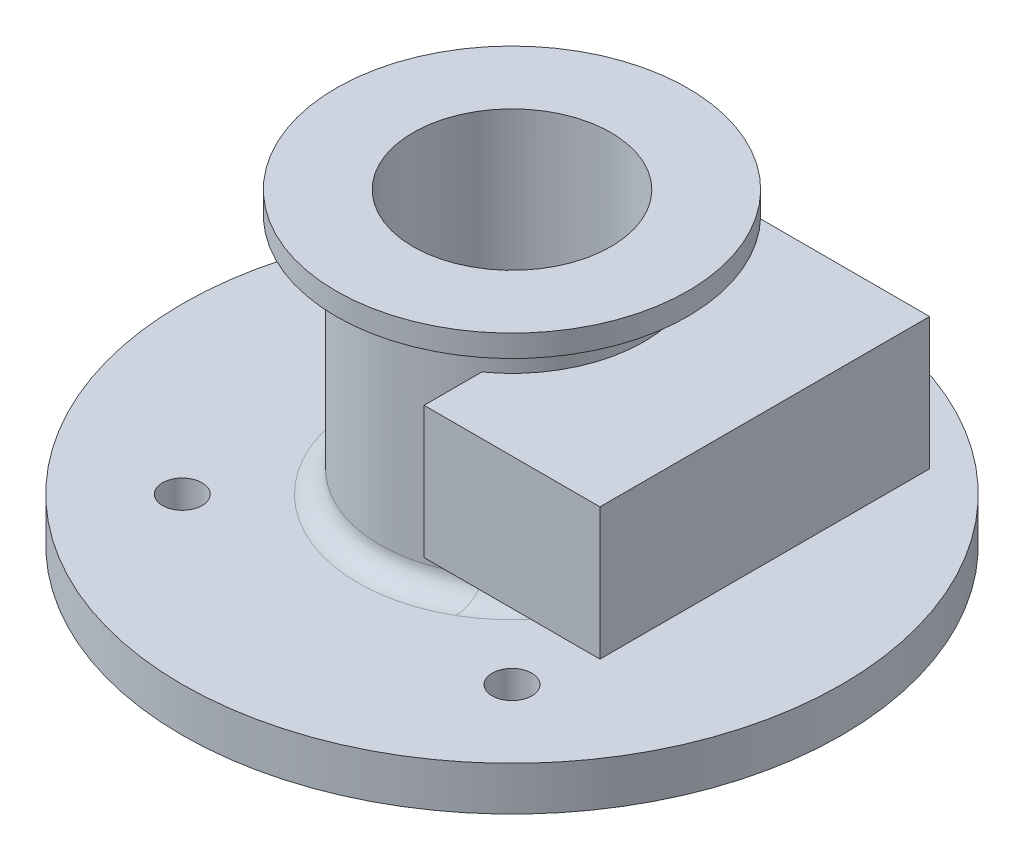
ISO-10303-21;
HEADER;
FILE_DESCRIPTION(('STEP AP214'),'2;1');
FILE_NAME('part.step','',(''),(''),'','','');
FILE_SCHEMA(('AUTOMOTIVE_DESIGN { 1 0 10303 214 1 1 1 1 }'));
ENDSEC;
DATA;
#1=APPLICATION_CONTEXT('core data for automotive mechanical design processes');
#2=APPLICATION_PROTOCOL_DEFINITION('international standard','automotive_design',2000,#1);
#3=PRODUCT_CONTEXT('',#1,'mechanical');
#4=PRODUCT('Part','Part','',(#3));
#5=PRODUCT_RELATED_PRODUCT_CATEGORY('part','',(#4));
#6=PRODUCT_DEFINITION_FORMATION('','',#4);
#7=PRODUCT_DEFINITION_CONTEXT('part definition',#1,'design');
#8=PRODUCT_DEFINITION('design','',#6,#7);
#9=PRODUCT_DEFINITION_SHAPE('','',#8);
#10=(LENGTH_UNIT() NAMED_UNIT(*) SI_UNIT(.MILLI.,.METRE.));
#11=(NAMED_UNIT(*) PLANE_ANGLE_UNIT() SI_UNIT($,.RADIAN.));
#12=(NAMED_UNIT(*) SI_UNIT($,.STERADIAN.) SOLID_ANGLE_UNIT());
#13=UNCERTAINTY_MEASURE_WITH_UNIT(LENGTH_MEASURE(1.E-05),#10,'distance_accuracy_value','');
#14=(GEOMETRIC_REPRESENTATION_CONTEXT(3) GLOBAL_UNCERTAINTY_ASSIGNED_CONTEXT((#13)) GLOBAL_UNIT_ASSIGNED_CONTEXT((#10,
#11,#12)) REPRESENTATION_CONTEXT('',''));
#15=CARTESIAN_POINT('',(0.,0.,0.));
#16=DIRECTION('',(0.,0.,1.));
#17=DIRECTION('',(1.,0.,0.));
#18=AXIS2_PLACEMENT_3D('',#15,#16,#17);
#19=CARTESIAN_POINT('',(0.,10.,0.));
#20=DIRECTION('',(0.,1.,0.));
#21=DIRECTION('',(0.,0.,1.));
#22=AXIS2_PLACEMENT_3D('',#19,#20,#21);
#23=CYLINDRICAL_SURFACE('',#22,22.5);
#24=CARTESIAN_POINT('',(0.,25.,0.));
#25=DIRECTION('',(0.,-1.,0.));
#26=DIRECTION('',(1.,0.,0.));
#27=AXIS2_PLACEMENT_3D('',#24,#25,#26);
#28=CIRCLE('',#27,22.5);
#29=CARTESIAN_POINT('',(22.5,25.,0.));
#30=VERTEX_POINT('',#29);
#31=EDGE_CURVE('E317',#30,#30,#28,.F.);
#32=ORIENTED_EDGE('',*,*,#31,.F.);
#33=EDGE_LOOP('',(#32));
#34=FACE_BOUND('',#33,.T.);
#35=CARTESIAN_POINT('',(0.,70.,0.));
#36=DIRECTION('',(0.,1.,0.));
#37=DIRECTION('',(0.,0.,1.));
#38=AXIS2_PLACEMENT_3D('',#35,#36,#37);
#39=CIRCLE('',#38,22.5);
#40=CARTESIAN_POINT('',(0.,70.,22.5));
#41=VERTEX_POINT('',#40);
#42=EDGE_CURVE('E131',#41,#41,#39,.T.);
#43=ORIENTED_EDGE('',*,*,#42,.T.);
#44=EDGE_LOOP('',(#43));
#45=FACE_BOUND('',#44,.T.);
#46=ADVANCED_FACE('F38',(#34,#45),#23,.F.);
#47=CARTESIAN_POINT('',(17.5,55.,-37.5));
#48=DIRECTION('',(1.,0.,0.));
#49=DIRECTION('',(0.,0.,-1.));
#50=AXIS2_PLACEMENT_3D('',#47,#48,#49);
#51=PLANE('',#50);
#52=DIRECTION('',(0.,0.,1.));
#53=VECTOR('',#52,1.);
#54=CARTESIAN_POINT('',(17.5,25.,-75.));
#55=LINE('',#54,#53);
#56=CARTESIAN_POINT('',(17.5,25.,24.3669858620224));
#57=VERTEX_POINT('',#56);
#58=CARTESIAN_POINT('',(17.5,25.,37.5));
#59=VERTEX_POINT('',#58);
#60=EDGE_CURVE('E109',#57,#59,#55,.T.);
#61=ORIENTED_EDGE('',*,*,#60,.T.);
#62=DIRECTION('',(0.,-1.,0.));
#63=VECTOR('',#62,1.);
#64=CARTESIAN_POINT('',(17.5,55.,37.5));
#65=LINE('',#64,#63);
#66=CARTESIAN_POINT('',(17.5,55.,37.5));
#67=VERTEX_POINT('',#66);
#68=EDGE_CURVE('E337',#67,#59,#65,.T.);
#69=ORIENTED_EDGE('',*,*,#68,.F.);
#70=DIRECTION('',(0.,0.,1.));
#71=VECTOR('',#70,1.);
#72=CARTESIAN_POINT('',(17.5,55.,-37.5));
#73=LINE('',#72,#71);
#74=CARTESIAN_POINT('',(17.5,55.,24.3669858620224));
#75=VERTEX_POINT('',#74);
#76=EDGE_CURVE('E120',#75,#67,#73,.T.);
#77=ORIENTED_EDGE('',*,*,#76,.F.);
#78=DIRECTION('',(0.,-1.,0.));
#79=VECTOR('',#78,1.);
#80=CARTESIAN_POINT('',(17.5,65.,24.3669858620224));
#81=LINE('',#80,#79);
#82=EDGE_CURVE('E53',#75,#57,#81,.T.);
#83=ORIENTED_EDGE('',*,*,#82,.T.);
#84=EDGE_LOOP('',(#61,#69,#77,#83));
#85=FACE_BOUND('',#84,.T.);
#86=ADVANCED_FACE('F119',(#85),#51,.F.);
#87=CARTESIAN_POINT('',(17.5,25.,-37.5));
#88=VERTEX_POINT('',#87);
#89=CARTESIAN_POINT('',(17.5,25.,-24.3669858620224));
#90=VERTEX_POINT('',#89);
#91=EDGE_CURVE('E116',#88,#90,#55,.T.);
#92=ORIENTED_EDGE('',*,*,#91,.T.);
#93=DIRECTION('',(0.,-1.,0.));
#94=VECTOR('',#93,1.);
#95=CARTESIAN_POINT('',(17.5,65.,-24.3669858620224));
#96=LINE('',#95,#94);
#97=CARTESIAN_POINT('',(17.5,55.,-24.3669858620224));
#98=VERTEX_POINT('',#97);
#99=EDGE_CURVE('E61',#90,#98,#96,.F.);
#100=ORIENTED_EDGE('',*,*,#99,.T.);
#101=CARTESIAN_POINT('',(17.5,55.,-37.5));
#102=VERTEX_POINT('',#101);
#103=EDGE_CURVE('E330',#102,#98,#73,.T.);
#104=ORIENTED_EDGE('',*,*,#103,.F.);
#105=DIRECTION('',(0.,-1.,0.));
#106=VECTOR('',#105,1.);
#107=CARTESIAN_POINT('',(17.5,55.,-37.5));
#108=LINE('',#107,#106);
#109=EDGE_CURVE('E126',#102,#88,#108,.T.);
#110=ORIENTED_EDGE('',*,*,#109,.T.);
#111=EDGE_LOOP('',(#92,#100,#104,#110));
#112=FACE_BOUND('',#111,.T.);
#113=ADVANCED_FACE('F200',(#112),#51,.F.);
#114=CARTESIAN_POINT('',(57.5,55.,37.5));
#115=DIRECTION('',(0.,0.,-1.));
#116=DIRECTION('',(-1.,0.,0.));
#117=AXIS2_PLACEMENT_3D('',#114,#115,#116);
#118=PLANE('',#117);
#119=DIRECTION('',(1.,0.,0.));
#120=VECTOR('',#119,1.);
#121=CARTESIAN_POINT('',(0.,25.,37.5));
#122=LINE('',#121,#120);
#123=CARTESIAN_POINT('',(57.5,25.,37.5));
#124=VERTEX_POINT('',#123);
#125=EDGE_CURVE('E112',#59,#124,#122,.T.);
#126=ORIENTED_EDGE('',*,*,#125,.T.);
#127=DIRECTION('',(0.,-1.,0.));
#128=VECTOR('',#127,1.);
#129=CARTESIAN_POINT('',(57.5,55.,37.5));
#130=LINE('',#129,#128);
#131=CARTESIAN_POINT('',(57.5,55.,37.5));
#132=VERTEX_POINT('',#131);
#133=EDGE_CURVE('E334',#132,#124,#130,.T.);
#134=ORIENTED_EDGE('',*,*,#133,.F.);
#135=DIRECTION('',(1.,0.,0.));
#136=VECTOR('',#135,1.);
#137=CARTESIAN_POINT('',(57.5,55.,37.5));
#138=LINE('',#137,#136);
#139=EDGE_CURVE('E332',#67,#132,#138,.T.);
#140=ORIENTED_EDGE('',*,*,#139,.F.);
#141=ORIENTED_EDGE('',*,*,#68,.T.);
#142=EDGE_LOOP('',(#126,#134,#140,#141));
#143=FACE_BOUND('',#142,.T.);
#144=ADVANCED_FACE('F201',(#143),#118,.F.);
#145=CARTESIAN_POINT('',(17.5,55.,-37.5));
#146=DIRECTION('',(0.,0.,1.));
#147=DIRECTION('',(1.,0.,0.));
#148=AXIS2_PLACEMENT_3D('',#145,#146,#147);
#149=PLANE('',#148);
#150=DIRECTION('',(1.,0.,0.));
#151=VECTOR('',#150,1.);
#152=CARTESIAN_POINT('',(17.5,25.,-37.5));
#153=LINE('',#152,#151);
#154=CARTESIAN_POINT('',(57.5,25.,-37.5));
#155=VERTEX_POINT('',#154);
#156=EDGE_CURVE('E322',#88,#155,#153,.T.);
#157=ORIENTED_EDGE('',*,*,#156,.F.);
#158=ORIENTED_EDGE('',*,*,#109,.F.);
#159=DIRECTION('',(-1.,0.,0.));
#160=VECTOR('',#159,1.);
#161=CARTESIAN_POINT('',(17.5,55.,-37.5));
#162=LINE('',#161,#160);
#163=CARTESIAN_POINT('',(57.5,55.,-37.5));
#164=VERTEX_POINT('',#163);
#165=EDGE_CURVE('E328',#164,#102,#162,.T.);
#166=ORIENTED_EDGE('',*,*,#165,.F.);
#167=DIRECTION('',(0.,-1.,0.));
#168=VECTOR('',#167,1.);
#169=CARTESIAN_POINT('',(57.5,55.,-37.5));
#170=LINE('',#169,#168);
#171=EDGE_CURVE('E121',#164,#155,#170,.T.);
#172=ORIENTED_EDGE('',*,*,#171,.T.);
#173=EDGE_LOOP('',(#157,#158,#166,#172));
#174=FACE_BOUND('',#173,.T.);
#175=ADVANCED_FACE('F203',(#174),#149,.F.);
#176=CARTESIAN_POINT('',(57.5,55.,-37.5));
#177=DIRECTION('',(-1.,0.,0.));
#178=DIRECTION('',(0.,0.,1.));
#179=AXIS2_PLACEMENT_3D('',#176,#177,#178);
#180=PLANE('',#179);
#181=DIRECTION('',(0.,0.,1.));
#182=VECTOR('',#181,1.);
#183=CARTESIAN_POINT('',(57.5,25.,-75.));
#184=LINE('',#183,#182);
#185=EDGE_CURVE('E321',#155,#124,#184,.T.);
#186=ORIENTED_EDGE('',*,*,#185,.F.);
#187=ORIENTED_EDGE('',*,*,#171,.F.);
#188=DIRECTION('',(0.,0.,-1.));
#189=VECTOR('',#188,1.);
#190=CARTESIAN_POINT('',(57.5,55.,-37.5));
#191=LINE('',#190,#189);
#192=EDGE_CURVE('E325',#132,#164,#191,.T.);
#193=ORIENTED_EDGE('',*,*,#192,.F.);
#194=ORIENTED_EDGE('',*,*,#133,.T.);
#195=EDGE_LOOP('',(#186,#187,#193,#194));
#196=FACE_BOUND('',#195,.T.);
#197=ADVANCED_FACE('F207',(#196),#180,.F.);
#198=CARTESIAN_POINT('',(0.,65.,0.));
#199=DIRECTION('',(0.,-1.,0.));
#200=DIRECTION('',(0.,0.,-1.));
#201=AXIS2_PLACEMENT_3D('',#198,#199,#200);
#202=CYLINDRICAL_SURFACE('',#201,30.);
#203=CARTESIAN_POINT('',(0.,25.,0.));
#204=DIRECTION('',(0.,-1.,0.));
#205=DIRECTION('',(1.,0.,0.));
#206=AXIS2_PLACEMENT_3D('',#203,#204,#205);
#207=CIRCLE('',#206,30.);
#208=EDGE_CURVE('E101',#57,#90,#207,.F.);
#209=ORIENTED_EDGE('',*,*,#208,.F.);
#210=ORIENTED_EDGE('',*,*,#82,.F.);
#211=CARTESIAN_POINT('',(0.,55.,0.));
#212=DIRECTION('',(0.,-1.,0.));
#213=DIRECTION('',(0.,0.,-1.));
#214=AXIS2_PLACEMENT_3D('',#211,#212,#213);
#215=CIRCLE('',#214,30.);
#216=EDGE_CURVE('E123',#98,#75,#215,.T.);
#217=ORIENTED_EDGE('',*,*,#216,.F.);
#218=ORIENTED_EDGE('',*,*,#99,.F.);
#219=EDGE_LOOP('',(#209,#210,#217,#218));
#220=FACE_BOUND('',#219,.T.);
#221=CARTESIAN_POINT('',(0.,15.,0.));
#222=DIRECTION('',(0.,1.,0.));
#223=DIRECTION('',(0.,0.,1.));
#224=AXIS2_PLACEMENT_3D('',#221,#222,#223);
#225=CIRCLE('',#224,30.);
#226=CARTESIAN_POINT('',(17.5,15.,-24.3669858620224));
#227=VERTEX_POINT('',#226);
#228=CARTESIAN_POINT('',(17.5,15.,24.3669858620224));
#229=VERTEX_POINT('',#228);
#230=EDGE_CURVE('E173',#227,#229,#225,.T.);
#231=ORIENTED_EDGE('',*,*,#230,.T.);
#232=CARTESIAN_POINT('',(0.,15.,0.));
#233=DIRECTION('',(0.,1.,0.));
#234=DIRECTION('',(0.,0.,1.));
#235=AXIS2_PLACEMENT_3D('',#232,#233,#234);
#236=CIRCLE('',#235,30.);
#237=EDGE_CURVE('E46',#229,#227,#236,.T.);
#238=ORIENTED_EDGE('',*,*,#237,.T.);
#239=EDGE_LOOP('',(#231,#238));
#240=FACE_BOUND('',#239,.T.);
#241=CARTESIAN_POINT('',(0.,60.,0.));
#242=DIRECTION('',(0.,1.,0.));
#243=DIRECTION('',(0.,0.,1.));
#244=AXIS2_PLACEMENT_3D('',#241,#242,#243);
#245=CIRCLE('',#244,30.);
#246=CARTESIAN_POINT('',(0.,60.,30.));
#247=VERTEX_POINT('',#246);
#248=EDGE_CURVE('E168',#247,#247,#245,.F.);
#249=ORIENTED_EDGE('',*,*,#248,.T.);
#250=EDGE_LOOP('',(#249));
#251=FACE_BOUND('',#250,.T.);
#252=ADVANCED_FACE('F103',(#220,#240,#251),#202,.T.);
#253=CARTESIAN_POINT('',(0.,10.,0.));
#254=DIRECTION('',(0.,1.,0.));
#255=DIRECTION('',(0.,0.,1.));
#256=AXIS2_PLACEMENT_3D('',#253,#254,#255);
#257=PLANE('',#256);
#258=CARTESIAN_POINT('',(0.,10.,0.));
#259=DIRECTION('',(0.,1.,0.));
#260=DIRECTION('',(0.,0.,1.));
#261=AXIS2_PLACEMENT_3D('',#258,#259,#260);
#262=CIRCLE('',#261,75.);
#263=CARTESIAN_POINT('',(0.,10.,75.));
#264=VERTEX_POINT('',#263);
#265=EDGE_CURVE('E165',#264,#264,#262,.T.);
#266=ORIENTED_EDGE('',*,*,#265,.T.);
#267=EDGE_LOOP('',(#266));
#268=FACE_BOUND('',#267,.T.);
#269=CARTESIAN_POINT('',(0.,10.,0.));
#270=DIRECTION('',(0.,1.,0.));
#271=DIRECTION('',(0.,0.,1.));
#272=AXIS2_PLACEMENT_3D('',#269,#270,#271);
#273=CIRCLE('',#272,35.);
#274=CARTESIAN_POINT('',(17.5,10.,30.3108891324554));
#275=VERTEX_POINT('',#274);
#276=CARTESIAN_POINT('',(17.5,10.,-30.3108891324554));
#277=VERTEX_POINT('',#276);
#278=EDGE_CURVE('E176',#275,#277,#273,.F.);
#279=ORIENTED_EDGE('',*,*,#278,.T.);
#280=CARTESIAN_POINT('',(0.,10.,0.));
#281=DIRECTION('',(0.,1.,0.));
#282=DIRECTION('',(0.,0.,1.));
#283=AXIS2_PLACEMENT_3D('',#280,#281,#282);
#284=CIRCLE('',#283,35.);
#285=EDGE_CURVE('E11',#277,#275,#284,.F.);
#286=ORIENTED_EDGE('',*,*,#285,.T.);
#287=EDGE_LOOP('',(#279,#286));
#288=FACE_BOUND('',#287,.T.);
#289=CARTESIAN_POINT('',(37.5000000000031,10.,37.5));
#290=DIRECTION('',(0.,1.,0.));
#291=DIRECTION('',(0.,0.,1.));
#292=AXIS2_PLACEMENT_3D('',#289,#290,#291);
#293=CIRCLE('',#292,4.49999999999881);
#294=CARTESIAN_POINT('',(37.5000000000031,10.,41.9999999999988));
#295=VERTEX_POINT('',#294);
#296=EDGE_CURVE('E141',#295,#295,#293,.T.);
#297=ORIENTED_EDGE('',*,*,#296,.F.);
#298=EDGE_LOOP('',(#297));
#299=FACE_BOUND('',#298,.T.);
#300=CARTESIAN_POINT('',(37.5,10.,-37.5));
#301=DIRECTION('',(0.,1.,0.));
#302=DIRECTION('',(0.,0.,1.));
#303=AXIS2_PLACEMENT_3D('',#300,#301,#302);
#304=CIRCLE('',#303,4.5);
#305=CARTESIAN_POINT('',(37.5,10.,-33.));
#306=VERTEX_POINT('',#305);
#307=EDGE_CURVE('E159',#306,#306,#304,.T.);
#308=ORIENTED_EDGE('',*,*,#307,.F.);
#309=EDGE_LOOP('',(#308));
#310=FACE_BOUND('',#309,.T.);
#311=CARTESIAN_POINT('',(-37.4999999999969,10.,37.5000000000031));
#312=DIRECTION('',(0.,1.,0.));
#313=DIRECTION('',(0.,0.,1.));
#314=AXIS2_PLACEMENT_3D('',#311,#312,#313);
#315=CIRCLE('',#314,4.50000000000187);
#316=CARTESIAN_POINT('',(-37.4999999999969,10.,42.000000000005));
#317=VERTEX_POINT('',#316);
#318=EDGE_CURVE('E147',#317,#317,#315,.T.);
#319=ORIENTED_EDGE('',*,*,#318,.F.);
#320=EDGE_LOOP('',(#319));
#321=FACE_BOUND('',#320,.T.);
#322=CARTESIAN_POINT('',(-37.5,10.,-37.4999999999969));
#323=DIRECTION('',(0.,1.,0.));
#324=DIRECTION('',(0.,0.,1.));
#325=AXIS2_PLACEMENT_3D('',#322,#323,#324);
#326=CIRCLE('',#325,4.50000000000287);
#327=CARTESIAN_POINT('',(-37.5,10.,-32.999999999994));
#328=VERTEX_POINT('',#327);
#329=EDGE_CURVE('E153',#328,#328,#326,.T.);
#330=ORIENTED_EDGE('',*,*,#329,.F.);
#331=EDGE_LOOP('',(#330));
#332=FACE_BOUND('',#331,.T.);
#333=ADVANCED_FACE('F212',(#268,#288,#299,#310,#321,#332),#257,.T.);
#334=CARTESIAN_POINT('',(0.,15.,0.));
#335=DIRECTION('',(0.,1.,0.));
#336=DIRECTION('',(0.,0.,1.));
#337=AXIS2_PLACEMENT_3D('',#334,#335,#336);
#338=TOROIDAL_SURFACE('',#337,35.,5.);
#339=CARTESIAN_POINT('',(17.5,11.1138911944391,-33.8950959507634));
#340=CARTESIAN_POINT('',(17.5,11.0165577768246,-33.7597907223011));
#341=CARTESIAN_POINT('',(17.5,10.9253980722928,-33.6200507936147));
#342=CARTESIAN_POINT('',(17.5,10.7557138681619,-33.3330327425688));
#343=CARTESIAN_POINT('',(17.5,10.6771951796616,-33.1857511940851));
#344=CARTESIAN_POINT('',(17.5,10.5329075657378,-32.8847770375727));
#345=CARTESIAN_POINT('',(17.5,10.4671596351574,-32.7310743689537));
#346=CARTESIAN_POINT('',(17.5,10.3486304492006,-32.4187262535867));
#347=CARTESIAN_POINT('',(17.5,10.2958545816141,-32.2600787837968));
#348=CARTESIAN_POINT('',(17.5,10.1575191383861,-31.780203929461));
#349=CARTESIAN_POINT('',(17.5,10.0911074984683,-31.4532555197329));
#350=CARTESIAN_POINT('',(17.5,10.009062472584,-30.7934680105569));
#351=CARTESIAN_POINT('',(17.5,9.99341133839264,-30.4606310109682));
#352=CARTESIAN_POINT('',(17.5,10.0124198654056,-29.7653655055213));
#353=CARTESIAN_POINT('',(17.5,10.05188739899,-29.4030598164645));
#354=CARTESIAN_POINT('',(17.5,10.1883719779905,-28.6891602005399));
#355=CARTESIAN_POINT('',(17.5,10.2854413390977,-28.3375763171117));
#356=CARTESIAN_POINT('',(17.5,10.5412044498594,-27.6399655934979));
#357=CARTESIAN_POINT('',(17.5,10.7023962640209,-27.2948465056319));
#358=CARTESIAN_POINT('',(17.5,11.0843240271652,-26.6394027658157));
#359=CARTESIAN_POINT('',(17.5,11.3049820443028,-26.329033321871));
#360=CARTESIAN_POINT('',(17.5,11.7416381653335,-25.8287269782175));
#361=CARTESIAN_POINT('',(17.5,11.9452340584819,-25.6280074624216));
#362=CARTESIAN_POINT('',(17.5,12.2730517192216,-25.3539514418561));
#363=CARTESIAN_POINT('',(17.5,12.3860990055728,-25.2670812208133));
#364=CARTESIAN_POINT('',(17.5,12.619236577656,-25.1034140973577));
#365=CARTESIAN_POINT('',(17.5,12.7393237057158,-25.0266127279098));
#366=CARTESIAN_POINT('',(17.5,12.9870971868042,-24.8835162321312));
#367=CARTESIAN_POINT('',(17.5,13.1148433640687,-24.8173244308342));
#368=CARTESIAN_POINT('',(17.5,13.3760225257483,-24.6974703348428));
#369=CARTESIAN_POINT('',(17.5,13.5094523729318,-24.6438012312752));
#370=CARTESIAN_POINT('',(17.5,13.780912195214,-24.5500237983482));
#371=CARTESIAN_POINT('',(17.5,13.9189390725387,-24.5099065321804));
#372=CARTESIAN_POINT('',(17.5,14.1983789913347,-24.4440595217596));
#373=CARTESIAN_POINT('',(17.5,14.3397913898461,-24.4183270678725));
#374=CARTESIAN_POINT('',(17.5,14.6038986171491,-24.3844810763768));
#375=CARTESIAN_POINT('',(17.5,14.7263391099103,-24.3743560173841));
#376=CARTESIAN_POINT('',(17.5,14.9716305824017,-24.36523240448));
#377=CARTESIAN_POINT('',(17.5,15.0944815249097,-24.3662328676216));
#378=CARTESIAN_POINT('',(17.5,15.3395542674826,-24.3793407167475));
#379=CARTESIAN_POINT('',(17.5,15.4617762199495,-24.3914452712025));
#380=CARTESIAN_POINT('',(17.5,15.7046422187062,-24.4265412442729));
#381=CARTESIAN_POINT('',(17.5,15.8252862736175,-24.4495326033785));
#382=CARTESIAN_POINT('',(17.5,16.0563858266955,-24.5041917051799));
#383=CARTESIAN_POINT('',(17.5,16.1669968208584,-24.5352046993249));
#384=CARTESIAN_POINT('',(17.5,16.3853939854585,-24.6059810926605));
#385=CARTESIAN_POINT('',(17.5,16.4931792594476,-24.645747232039));
#386=CARTESIAN_POINT('',(17.5,16.8113418424307,-24.7774176492973));
#387=CARTESIAN_POINT('',(17.5,17.0166969303626,-24.8817353620547));
#388=CARTESIAN_POINT('',(17.5,17.4262397271338,-25.1285069791827));
#389=CARTESIAN_POINT('',(17.5,17.6289460005579,-25.2733895730699));
#390=CARTESIAN_POINT('',(17.5,18.0115478047563,-25.5906187913365));
#391=CARTESIAN_POINT('',(17.5,18.1914315196339,-25.7629795385909));
#392=CARTESIAN_POINT('',(17.5,18.554476471726,-26.1601615324192));
#393=CARTESIAN_POINT('',(17.5,18.7332949806572,-26.3889473188028));
#394=CARTESIAN_POINT('',(17.5,19.0566191268254,-26.8695619137637));
#395=CARTESIAN_POINT('',(17.5,19.201103396811,-27.1214049372375));
#396=CARTESIAN_POINT('',(17.5,19.4765924851975,-27.6866287534159));
#397=CARTESIAN_POINT('',(17.5,19.6011094038631,-28.0031846793824));
#398=CARTESIAN_POINT('',(17.5,19.800940326826,-28.651458696943));
#399=CARTESIAN_POINT('',(17.5,19.8762263152413,-28.9831853070544));
#400=CARTESIAN_POINT('',(17.5,19.981470650821,-29.6891968390827));
#401=CARTESIAN_POINT('',(17.5,20.005938905618,-30.0643363467077));
#402=CARTESIAN_POINT('',(17.5,19.9951917360112,-30.6258250129884));
#403=CARTESIAN_POINT('',(17.5,19.983676913838,-30.8129121512701));
#404=CARTESIAN_POINT('',(17.5,19.9446140067636,-31.185381789568));
#405=CARTESIAN_POINT('',(17.5,19.9170732018042,-31.3707650247818));
#406=CARTESIAN_POINT('',(17.5,19.8458635011866,-31.7379925751397));
#407=CARTESIAN_POINT('',(17.5,19.8022293782382,-31.9198436369657));
#408=CARTESIAN_POINT('',(17.5,19.698745200603,-32.2788012914464));
#409=CARTESIAN_POINT('',(17.5,19.6389026254509,-32.4559100311668));
#410=CARTESIAN_POINT('',(17.5,19.5029915351119,-32.8037853875113));
#411=CARTESIAN_POINT('',(17.5,19.4269245572044,-32.9745526032029));
#412=CARTESIAN_POINT('',(17.5,19.258694818893,-33.3079707168217));
#413=CARTESIAN_POINT('',(17.5,19.1665340706113,-33.4706226260997));
#414=CARTESIAN_POINT('',(17.5,18.9756072953717,-33.7714724500703));
#415=CARTESIAN_POINT('',(17.5,18.8782197084106,-33.9105455836279));
#416=CARTESIAN_POINT('',(17.5,18.6708363436153,-34.1789440365104));
#417=CARTESIAN_POINT('',(17.5,18.5608425722309,-34.3082709016732));
#418=CARTESIAN_POINT('',(17.5,18.3289103617086,-34.5555807348208));
#419=CARTESIAN_POINT('',(17.5,18.2069802337917,-34.6735714842429));
#420=CARTESIAN_POINT('',(17.5,17.9519281427595,-34.896766670243));
#421=CARTESIAN_POINT('',(17.5,17.8188078628201,-35.0019730239949));
#422=CARTESIAN_POINT('',(17.5,17.5597883828176,-35.185795275648));
#423=CARTESIAN_POINT('',(17.5,17.435079002384,-35.266091245032));
#424=CARTESIAN_POINT('',(17.5,17.1787826962398,-35.4148217475845));
#425=CARTESIAN_POINT('',(17.5,17.0471967555294,-35.4832579735168));
#426=CARTESIAN_POINT('',(17.5,16.7782299033842,-35.60738184163));
#427=CARTESIAN_POINT('',(17.5,16.6408523859441,-35.663076830781));
#428=CARTESIAN_POINT('',(17.5,16.3613864288759,-35.7610285763895));
#429=CARTESIAN_POINT('',(17.5,16.219298386487,-35.8032864628325));
#430=CARTESIAN_POINT('',(17.5,15.9463797317482,-35.8701834164964));
#431=CARTESIAN_POINT('',(17.5,15.8158804391326,-35.8961806081954));
#432=CARTESIAN_POINT('',(17.5,15.5531021082058,-35.9365768651907));
#433=CARTESIAN_POINT('',(17.5,15.4208232035015,-35.9509767962823));
#434=CARTESIAN_POINT('',(17.5,15.155553085654,-35.9680081000024));
#435=CARTESIAN_POINT('',(17.5,15.0225621140143,-35.9706432373828));
#436=CARTESIAN_POINT('',(17.5,14.7568695783414,-35.9641241254434));
#437=CARTESIAN_POINT('',(17.5,14.624168010289,-35.954970040912));
#438=CARTESIAN_POINT('',(17.5,14.3661620963995,-35.9256709567017));
#439=CARTESIAN_POINT('',(17.5,14.2407978633168,-35.9060498946741));
#440=CARTESIAN_POINT('',(17.5,13.9921111020558,-35.8563759260666));
#441=CARTESIAN_POINT('',(17.5,13.8687892629461,-35.8263195710036));
#442=CARTESIAN_POINT('',(17.5,13.6250891167029,-35.756094143573));
#443=CARTESIAN_POINT('',(17.5,13.5047102442487,-35.7159270304173));
#444=CARTESIAN_POINT('',(17.5,13.2676034496311,-35.6258636543045));
#445=CARTESIAN_POINT('',(17.5,13.1508768724559,-35.5759638550189));
#446=CARTESIAN_POINT('',(17.5,12.9199825325764,-35.4660459976002));
#447=CARTESIAN_POINT('',(17.5,12.8058861968067,-35.4058780059687));
#448=CARTESIAN_POINT('',(17.5,12.582856425449,-35.276545768925));
#449=CARTESIAN_POINT('',(17.5,12.4739251377429,-35.2073778248869));
#450=CARTESIAN_POINT('',(17.5,12.2619567601176,-35.0607564394031));
#451=CARTESIAN_POINT('',(17.5,12.158913827083,-34.9833114384961));
#452=CARTESIAN_POINT('',(17.5,11.9590833576543,-34.8207246646105));
#453=CARTESIAN_POINT('',(17.5,11.8622967370525,-34.7355817691782));
#454=CARTESIAN_POINT('',(17.5,11.6481027353919,-34.5323738514802));
#455=CARTESIAN_POINT('',(17.5,11.5329205222344,-34.4119523925785));
#456=CARTESIAN_POINT('',(17.5,11.3144052539738,-34.1608588768685));
#457=CARTESIAN_POINT('',(17.5,11.2110710972036,-34.030187775008));
#458=CARTESIAN_POINT('',(17.5,11.1138911944391,-33.8950959507634));
#459=B_SPLINE_CURVE_WITH_KNOTS('',3,(#339,#340,#341,#342,#343,#344,#345,#346,#347,#348,#349,
#350,#351,#352,#353,#354,#355,#356,#357,#358,#359,#360,#361,#362,#363,#364,#365,#366,#367,#368,
#369,#370,#371,#372,#373,#374,#375,#376,#377,#378,#379,#380,#381,#382,#383,#384,#385,#386,#387,
#388,#389,#390,#391,#392,#393,#394,#395,#396,#397,#398,#399,#400,#401,#402,#403,#404,#405,#406,
#407,#408,#409,#410,#411,#412,#413,#414,#415,#416,#417,#418,#419,#420,#421,#422,#423,#424,#425,
#426,#427,#428,#429,#430,#431,#432,#433,#434,#435,#436,#437,#438,#439,#440,#441,#442,#443,#444,
#445,#446,#447,#448,#449,#450,#451,#452,#453,#454,#455,#456,#457,#458),.UNSPECIFIED.,.T.,.F.,(4,
2,2,2,2,2,2,2,2,2,2,2,2,2,2,2,2,2,2,2,2,2,2,2,2,2,2,2,2,2,2,2,2,2,2,2,2,2,2,2,2,2,2,2,2,2,2,2,2,
2,2,2,2,2,2,2,2,2,2,4),(0.,0.499861575053503,0.99995228529394,1.50085830154176,2.00197201284017,
2.99833596803015,3.99435151063377,5.08287675509227,6.17239214691009,7.30932364925384,
8.44477236159972,9.29877591570857,9.72603513982693,10.1531041647351,10.5841082123285,
11.0148773643515,11.4453618869922,11.8757652929041,12.2438532409998,12.6119086685488,
12.9798702685022,13.3478298571095,13.6920727412073,14.0364235448177,14.7246031461316,
15.4693102202956,16.2144012909732,17.0822487118251,17.9506348145937,18.9669348185142,
19.9838126668847,21.1058071228649,21.6675741783027,22.229086245169,22.7893920976985,
23.3494398313164,23.9094345233727,24.469359252208,24.9779921064335,25.4865441167945,
25.9947445102249,26.5028685985986,26.9472349984119,27.3915379206265,27.8355839953477,
28.2795927183837,28.6782801724211,29.0769378596251,29.4754679666155,29.873992503057,
30.2542190798556,30.6345714274297,31.0148501288987,31.3952672612195,31.7818075029851,
32.1685071022639,32.5548160602169,32.9411814381911,33.4403010758798,33.93937426626),.UNSPECIFIED.);
#460=EDGE_CURVE('E106',#277,#227,#459,.T.);
#461=ORIENTED_EDGE('',*,*,#460,.F.);
#462=ORIENTED_EDGE('',*,*,#278,.F.);
#463=CARTESIAN_POINT('',(17.5,12.983918877773,24.8877230697492));
#464=CARTESIAN_POINT('',(17.5,12.8518865475506,24.9588437175505));
#465=CARTESIAN_POINT('',(17.5,12.7232874124027,25.0363649005055));
#466=CARTESIAN_POINT('',(17.5,12.4737288907833,25.2029037230215));
#467=CARTESIAN_POINT('',(17.5,12.3527742887213,25.2919284581483));
#468=CARTESIAN_POINT('',(17.5,12.0017637412936,25.57478118208));
#469=CARTESIAN_POINT('',(17.5,11.7840078862035,25.7841410017579));
#470=CARTESIAN_POINT('',(17.5,11.3861755479013,26.2326241352096));
#471=CARTESIAN_POINT('',(17.5,11.205822778855,26.4715067549719));
#472=CARTESIAN_POINT('',(17.5,10.881816075593,26.972664815754));
#473=CARTESIAN_POINT('',(17.5,10.7381429260207,27.2349279108805));
#474=CARTESIAN_POINT('',(17.5,10.4699022956513,27.8162891365952));
#475=CARTESIAN_POINT('',(17.5,10.3511894100661,28.1380939310707));
#476=CARTESIAN_POINT('',(17.5,10.1639314374101,28.7960647707058));
#477=CARTESIAN_POINT('',(17.5,10.0954238223275,29.1322413449599));
#478=CARTESIAN_POINT('',(17.5,10.0058097990115,29.8446489108485));
#479=CARTESIAN_POINT('',(17.5,9.98999663571787,30.2215808432925));
#480=CARTESIAN_POINT('',(17.5,10.0142331748708,30.784594534612));
#481=CARTESIAN_POINT('',(17.5,10.0303314334616,30.9719922441324));
#482=CARTESIAN_POINT('',(17.5,10.0787243734457,31.3446602309964));
#483=CARTESIAN_POINT('',(17.5,10.1110114923868,31.5299314604048));
#484=CARTESIAN_POINT('',(17.5,10.1915473822335,31.8950858108899));
#485=CARTESIAN_POINT('',(17.5,10.2396383880911,32.0750037535322));
#486=CARTESIAN_POINT('',(17.5,10.3519123561805,32.4296746073104));
#487=CARTESIAN_POINT('',(17.5,10.4160877120178,32.6044299163441));
#488=CARTESIAN_POINT('',(17.5,10.5605047041654,32.9471593114533));
#489=CARTESIAN_POINT('',(17.5,10.6407441176368,33.1151343318808));
#490=CARTESIAN_POINT('',(17.5,10.8171168014839,33.4425269382483));
#491=CARTESIAN_POINT('',(17.5,10.9132480001302,33.601945636048));
#492=CARTESIAN_POINT('',(17.5,11.1110438506158,33.8955136271002));
#493=CARTESIAN_POINT('',(17.5,11.2112899725915,34.0306192744135));
#494=CARTESIAN_POINT('',(17.5,11.4240124887771,34.2908260647125));
#495=CARTESIAN_POINT('',(17.5,11.5364869195634,34.4159288082209));
#496=CARTESIAN_POINT('',(17.5,11.7729578857047,34.6545704620089));
#497=CARTESIAN_POINT('',(17.5,11.8969463237069,34.7681173830164));
#498=CARTESIAN_POINT('',(17.5,12.1556534859002,34.9822501391597));
#499=CARTESIAN_POINT('',(17.5,12.2903706231955,35.0828378853637));
#500=CARTESIAN_POINT('',(17.5,12.5519088547235,35.2578896282507));
#501=CARTESIAN_POINT('',(17.5,12.6775984533129,35.3340478942648));
#502=CARTESIAN_POINT('',(17.5,12.9354531103623,35.4744630258289));
#503=CARTESIAN_POINT('',(17.5,13.067617268971,35.5387215393367));
#504=CARTESIAN_POINT('',(17.5,13.3373271289516,35.6545063386275));
#505=CARTESIAN_POINT('',(17.5,13.4748697675711,35.7060397518023));
#506=CARTESIAN_POINT('',(17.5,13.7542475701563,35.795739703205));
#507=CARTESIAN_POINT('',(17.5,13.8960823971744,35.8339072877422));
#508=CARTESIAN_POINT('',(17.5,14.1685989436212,35.8932689706012));
#509=CARTESIAN_POINT('',(17.5,14.2989979935398,35.9157675259401));
#510=CARTESIAN_POINT('',(17.5,14.5612645592863,35.9492327556139));
#511=CARTESIAN_POINT('',(17.5,14.6931319732406,35.9602002249888));
#512=CARTESIAN_POINT('',(17.5,14.9572837993233,35.9704751888878));
#513=CARTESIAN_POINT('',(17.5,15.0895680896414,35.9697858214368));
#514=CARTESIAN_POINT('',(17.5,15.3535621362631,35.9567628888847));
#515=CARTESIAN_POINT('',(17.5,15.4852718979313,35.9444294327451));
#516=CARTESIAN_POINT('',(17.5,15.7416793016572,35.9090117070976));
#517=CARTESIAN_POINT('',(17.5,15.8664416230022,35.8863932886418));
#518=CARTESIAN_POINT('',(17.5,16.113683682593,35.8308179512979));
#519=CARTESIAN_POINT('',(17.5,16.2361626577416,35.7978576395038));
#520=CARTESIAN_POINT('',(17.5,16.4779328877066,35.7219523046315));
#521=CARTESIAN_POINT('',(17.5,16.5972253096365,35.6790109947081));
#522=CARTESIAN_POINT('',(17.5,16.831957696341,35.5835459953915));
#523=CARTESIAN_POINT('',(17.5,16.9473961909183,35.5310186974469));
#524=CARTESIAN_POINT('',(17.5,17.1759451403012,35.4157491885766));
#525=CARTESIAN_POINT('',(17.5,17.2889637909231,35.3528247824725));
#526=CARTESIAN_POINT('',(17.5,17.5096130623627,35.2181220550707));
#527=CARTESIAN_POINT('',(17.5,17.6172417236713,35.1463405461903));
#528=CARTESIAN_POINT('',(17.5,17.9311199486386,34.9186685322765));
#529=CARTESIAN_POINT('',(17.5,18.128534027981,34.750362762042));
#530=CARTESIAN_POINT('',(17.5,18.5089252153235,34.3733581203377));
#531=CARTESIAN_POINT('',(17.5,18.6898854385284,34.1626410529144));
#532=CARTESIAN_POINT('',(17.5,19.0178346378709,33.7162698541265));
#533=CARTESIAN_POINT('',(17.5,19.1648106346698,33.4806062450461));
#534=CARTESIAN_POINT('',(17.5,19.4368924545337,32.9650909838856));
#535=CARTESIAN_POINT('',(17.5,19.55811771643,32.6831942423299));
#536=CARTESIAN_POINT('',(17.5,19.7569594996634,32.1044550853986));
#537=CARTESIAN_POINT('',(17.5,19.8345559421936,31.8076058569685));
#538=CARTESIAN_POINT('',(17.5,19.9528643304822,31.1715398090564));
#539=CARTESIAN_POINT('',(17.5,19.9883624842115,30.8313511761388));
#540=CARTESIAN_POINT('',(17.5,20.0067931026371,30.1495411699037));
#541=CARTESIAN_POINT('',(17.5,19.9897034273822,29.8079192536214));
#542=CARTESIAN_POINT('',(17.5,19.9005172827465,29.1011380402772));
#543=CARTESIAN_POINT('',(17.5,19.8236846798917,28.7365726913403));
#544=CARTESIAN_POINT('',(17.5,19.610708264069,28.0245829193417));
#545=CARTESIAN_POINT('',(17.5,19.4745168867975,27.6771724916085));
#546=CARTESIAN_POINT('',(17.5,19.2259649534711,27.1755192721413));
#547=CARTESIAN_POINT('',(17.5,19.1349309387286,27.0104473826586));
#548=CARTESIAN_POINT('',(17.5,18.9381923506812,26.6891850653954));
#549=CARTESIAN_POINT('',(17.5,18.8324859692828,26.5329957355727));
#550=CARTESIAN_POINT('',(17.5,18.6068782807218,26.2316259339739));
#551=CARTESIAN_POINT('',(17.5,18.4870028010602,26.0864261995107));
#552=CARTESIAN_POINT('',(17.5,18.2333504018451,25.8087577918731));
#553=CARTESIAN_POINT('',(17.5,18.0995733045653,25.6762892815038));
#554=CARTESIAN_POINT('',(17.5,17.7603142412164,25.3744373466184));
#555=CARTESIAN_POINT('',(17.5,17.5480594183484,25.2124460802999));
#556=CARTESIAN_POINT('',(17.5,17.212153808189,24.9973576020196));
#557=CARTESIAN_POINT('',(17.5,17.0972423184803,24.9303015670857));
#558=CARTESIAN_POINT('',(17.5,16.8620929854934,24.8063330357093));
#559=CARTESIAN_POINT('',(17.5,16.7418578030199,24.7494155418638));
#560=CARTESIAN_POINT('',(17.5,16.4958327086835,24.6461991730855));
#561=CARTESIAN_POINT('',(17.5,16.3700075911853,24.599984085457));
#562=CARTESIAN_POINT('',(17.5,16.1146320724527,24.5195534752354));
#563=CARTESIAN_POINT('',(17.5,15.985083553958,24.4853319996727));
#564=CARTESIAN_POINT('',(17.5,15.7232944570922,24.4295186363448));
#565=CARTESIAN_POINT('',(17.5,15.5910540486088,24.4079259541059));
#566=CARTESIAN_POINT('',(17.5,15.3250999708378,24.3778138648137));
#567=CARTESIAN_POINT('',(17.5,15.1913865074084,24.3692926538015));
#568=CARTESIAN_POINT('',(17.5,14.9394768831353,24.3657182919878));
#569=CARTESIAN_POINT('',(17.5,14.8212991137287,24.3692034750232));
#570=CARTESIAN_POINT('',(17.5,14.585696962911,24.3864330174809));
#571=CARTESIAN_POINT('',(17.5,14.4682725483174,24.4001769218706));
#572=CARTESIAN_POINT('',(17.5,14.2351604661103,24.4376812581939));
#573=CARTESIAN_POINT('',(17.5,14.1194711789356,24.4614316582603));
#574=CARTESIAN_POINT('',(17.5,13.8905372490502,24.5185684258193));
#575=CARTESIAN_POINT('',(17.5,13.7772919871484,24.5519523211298));
#576=CARTESIAN_POINT('',(17.5,13.5480582591429,24.6298675277368));
#577=CARTESIAN_POINT('',(17.5,13.4322373099594,24.6748915646211));
#578=CARTESIAN_POINT('',(17.5,13.2048010991381,24.7743925105517));
#579=CARTESIAN_POINT('',(17.5,13.0931843499488,24.8288660371545));
#580=CARTESIAN_POINT('',(17.5,12.983918877773,24.8877230697492));
#581=B_SPLINE_CURVE_WITH_KNOTS('',3,(#463,#464,#465,#466,#467,#468,#469,#470,#471,#472,#473,
#474,#475,#476,#477,#478,#479,#480,#481,#482,#483,#484,#485,#486,#487,#488,#489,#490,#491,#492,
#493,#494,#495,#496,#497,#498,#499,#500,#501,#502,#503,#504,#505,#506,#507,#508,#509,#510,#511,
#512,#513,#514,#515,#516,#517,#518,#519,#520,#521,#522,#523,#524,#525,#526,#527,#528,#529,#530,
#531,#532,#533,#534,#535,#536,#537,#538,#539,#540,#541,#542,#543,#544,#545,#546,#547,#548,#549,
#550,#551,#552,#553,#554,#555,#556,#557,#558,#559,#560,#561,#562,#563,#564,#565,#566,#567,#568,
#569,#570,#571,#572,#573,#574,#575,#576,#577,#578,#579,#580),.UNSPECIFIED.,.T.,.F.,(4,2,2,2,2,2,
2,2,2,2,2,2,2,2,2,2,2,2,2,2,2,2,2,2,2,2,2,2,2,2,2,2,2,2,2,2,2,2,2,2,2,2,2,2,2,2,2,2,2,2,2,2,2,2,
2,2,2,2,4),(0.,0.44975825959059,0.899795273110698,1.80137883643704,2.6960447493035,
3.59024100721022,4.61502844161719,5.64057997550699,6.76646658664324,7.33016024055602,
7.89359081601943,8.45155954114022,9.00926489544363,9.56689313141335,10.1244487295304,
10.6284470829257,11.1323646316079,11.6359304404098,12.1394219039866,12.5797131371874,
13.0199433502202,13.459926425959,13.8998750510602,14.2963545518586,14.6928067145795,
15.0891521539271,15.4854938844461,15.8654395812263,16.2455100588665,16.6254393674522,
17.005511992838,17.3931349555072,17.7808978289296,18.5558500584576,19.3857635759523,
20.215993534425,21.1328263575666,22.0500807798433,23.0719108789369,24.094171236585,
25.206938662945,26.3205993960969,26.8854880337036,27.4504463451227,28.0143902842283,
28.5783414340051,29.3755384816011,29.774281404556,30.1728272353779,30.5743950120026,
30.9757631892416,31.3771061138066,31.7783936451195,32.132641339354,32.4868733216211,
32.8407510156275,33.1945379769079,33.5668756412813,33.9390803014304),.UNSPECIFIED.);
#582=EDGE_CURVE('E182',#229,#275,#581,.T.);
#583=ORIENTED_EDGE('',*,*,#582,.F.);
#584=ORIENTED_EDGE('',*,*,#230,.F.);
#585=EDGE_LOOP('',(#461,#462,#583,#584));
#586=FACE_BOUND('',#585,.T.);
#587=ADVANCED_FACE('F193',(#586),#338,.F.);
#588=CARTESIAN_POINT('',(0.,0.,0.));
#589=DIRECTION('',(0.,1.,0.));
#590=DIRECTION('',(0.,0.,1.));
#591=AXIS2_PLACEMENT_3D('',#588,#589,#590);
#592=PLANE('',#591);
#593=CARTESIAN_POINT('',(0.,0.,0.));
#594=DIRECTION('',(0.,1.,0.));
#595=DIRECTION('',(0.,0.,1.));
#596=AXIS2_PLACEMENT_3D('',#593,#594,#595);
#597=CIRCLE('',#596,75.);
#598=CARTESIAN_POINT('',(0.,0.,75.));
#599=VERTEX_POINT('',#598);
#600=EDGE_CURVE('E162',#599,#599,#597,.T.);
#601=ORIENTED_EDGE('',*,*,#600,.F.);
#602=EDGE_LOOP('',(#601));
#603=FACE_BOUND('',#602,.T.);
#604=CARTESIAN_POINT('',(37.5,0.,-37.5));
#605=DIRECTION('',(0.,1.,0.));
#606=DIRECTION('',(0.,0.,1.));
#607=AXIS2_PLACEMENT_3D('',#604,#605,#606);
#608=CIRCLE('',#607,4.5);
#609=CARTESIAN_POINT('',(37.5,0.,-33.));
#610=VERTEX_POINT('',#609);
#611=EDGE_CURVE('E156',#610,#610,#608,.T.);
#612=ORIENTED_EDGE('',*,*,#611,.T.);
#613=EDGE_LOOP('',(#612));
#614=FACE_BOUND('',#613,.T.);
#615=CARTESIAN_POINT('',(-37.5,0.,-37.4999999999969));
#616=DIRECTION('',(0.,1.,0.));
#617=DIRECTION('',(0.,0.,1.));
#618=AXIS2_PLACEMENT_3D('',#615,#616,#617);
#619=CIRCLE('',#618,4.50000000000287);
#620=CARTESIAN_POINT('',(-37.5,0.,-32.999999999994));
#621=VERTEX_POINT('',#620);
#622=EDGE_CURVE('E150',#621,#621,#619,.T.);
#623=ORIENTED_EDGE('',*,*,#622,.T.);
#624=EDGE_LOOP('',(#623));
#625=FACE_BOUND('',#624,.T.);
#626=CARTESIAN_POINT('',(-37.4999999999969,0.,37.5000000000031));
#627=DIRECTION('',(0.,1.,0.));
#628=DIRECTION('',(0.,0.,1.));
#629=AXIS2_PLACEMENT_3D('',#626,#627,#628);
#630=CIRCLE('',#629,4.50000000000187);
#631=CARTESIAN_POINT('',(-37.4999999999969,0.,42.000000000005));
#632=VERTEX_POINT('',#631);
#633=EDGE_CURVE('E144',#632,#632,#630,.T.);
#634=ORIENTED_EDGE('',*,*,#633,.T.);
#635=EDGE_LOOP('',(#634));
#636=FACE_BOUND('',#635,.T.);
#637=CARTESIAN_POINT('',(37.5000000000031,0.,37.5));
#638=DIRECTION('',(0.,1.,0.));
#639=DIRECTION('',(0.,0.,1.));
#640=AXIS2_PLACEMENT_3D('',#637,#638,#639);
#641=CIRCLE('',#640,4.49999999999881);
#642=CARTESIAN_POINT('',(37.5000000000031,0.,41.9999999999988));
#643=VERTEX_POINT('',#642);
#644=EDGE_CURVE('E138',#643,#643,#641,.T.);
#645=ORIENTED_EDGE('',*,*,#644,.T.);
#646=EDGE_LOOP('',(#645));
#647=FACE_BOUND('',#646,.T.);
#648=ADVANCED_FACE('F251',(#603,#614,#625,#636,#647),#592,.F.);
#649=CARTESIAN_POINT('',(0.,10.,0.));
#650=DIRECTION('',(0.,-1.,0.));
#651=DIRECTION('',(0.,0.,-1.));
#652=AXIS2_PLACEMENT_3D('',#649,#650,#651);
#653=CYLINDRICAL_SURFACE('',#652,75.);
#654=ORIENTED_EDGE('',*,*,#265,.F.);
#655=EDGE_LOOP('',(#654));
#656=FACE_BOUND('',#655,.T.);
#657=ORIENTED_EDGE('',*,*,#600,.T.);
#658=EDGE_LOOP('',(#657));
#659=FACE_BOUND('',#658,.T.);
#660=ADVANCED_FACE('F249',(#656,#659),#653,.T.);
#661=CARTESIAN_POINT('',(37.5,10.,-37.5));
#662=DIRECTION('',(0.,-1.,0.));
#663=DIRECTION('',(0.,0.,-1.));
#664=AXIS2_PLACEMENT_3D('',#661,#662,#663);
#665=CYLINDRICAL_SURFACE('',#664,4.5);
#666=ORIENTED_EDGE('',*,*,#307,.T.);
#667=EDGE_LOOP('',(#666));
#668=FACE_BOUND('',#667,.T.);
#669=ORIENTED_EDGE('',*,*,#611,.F.);
#670=EDGE_LOOP('',(#669));
#671=FACE_BOUND('',#670,.T.);
#672=ADVANCED_FACE('F245',(#668,#671),#665,.F.);
#673=CARTESIAN_POINT('',(-37.5,10.,-37.4999999999969));
#674=DIRECTION('',(0.,-1.,0.));
#675=DIRECTION('',(0.,0.,-1.));
#676=AXIS2_PLACEMENT_3D('',#673,#674,#675);
#677=CYLINDRICAL_SURFACE('',#676,4.50000000000287);
#678=ORIENTED_EDGE('',*,*,#329,.T.);
#679=EDGE_LOOP('',(#678));
#680=FACE_BOUND('',#679,.T.);
#681=ORIENTED_EDGE('',*,*,#622,.F.);
#682=EDGE_LOOP('',(#681));
#683=FACE_BOUND('',#682,.T.);
#684=ADVANCED_FACE('F241',(#680,#683),#677,.F.);
#685=CARTESIAN_POINT('',(-37.4999999999969,10.,37.5000000000031));
#686=DIRECTION('',(0.,-1.,0.));
#687=DIRECTION('',(0.,0.,-1.));
#688=AXIS2_PLACEMENT_3D('',#685,#686,#687);
#689=CYLINDRICAL_SURFACE('',#688,4.50000000000187);
#690=ORIENTED_EDGE('',*,*,#318,.T.);
#691=EDGE_LOOP('',(#690));
#692=FACE_BOUND('',#691,.T.);
#693=ORIENTED_EDGE('',*,*,#633,.F.);
#694=EDGE_LOOP('',(#693));
#695=FACE_BOUND('',#694,.T.);
#696=ADVANCED_FACE('F237',(#692,#695),#689,.F.);
#697=CARTESIAN_POINT('',(37.5000000000031,10.,37.5));
#698=DIRECTION('',(0.,-1.,0.));
#699=DIRECTION('',(0.,0.,-1.));
#700=AXIS2_PLACEMENT_3D('',#697,#698,#699);
#701=CYLINDRICAL_SURFACE('',#700,4.49999999999881);
#702=ORIENTED_EDGE('',*,*,#296,.T.);
#703=EDGE_LOOP('',(#702));
#704=FACE_BOUND('',#703,.T.);
#705=ORIENTED_EDGE('',*,*,#644,.F.);
#706=EDGE_LOOP('',(#705));
#707=FACE_BOUND('',#706,.T.);
#708=ADVANCED_FACE('F231',(#704,#707),#701,.F.);
#709=CARTESIAN_POINT('',(0.,70.,0.));
#710=DIRECTION('',(0.,-1.,0.));
#711=DIRECTION('',(0.,0.,-1.));
#712=AXIS2_PLACEMENT_3D('',#709,#710,#711);
#713=CYLINDRICAL_SURFACE('',#712,40.);
#714=CARTESIAN_POINT('',(0.,70.,0.));
#715=DIRECTION('',(0.,1.,0.));
#716=DIRECTION('',(0.,0.,1.));
#717=AXIS2_PLACEMENT_3D('',#714,#715,#716);
#718=CIRCLE('',#717,40.);
#719=CARTESIAN_POINT('',(0.,70.,40.));
#720=VERTEX_POINT('',#719);
#721=EDGE_CURVE('E135',#720,#720,#718,.T.);
#722=ORIENTED_EDGE('',*,*,#721,.F.);
#723=EDGE_LOOP('',(#722));
#724=FACE_BOUND('',#723,.T.);
#725=CARTESIAN_POINT('',(0.,65.,0.));
#726=DIRECTION('',(0.,1.,0.));
#727=DIRECTION('',(0.,0.,1.));
#728=AXIS2_PLACEMENT_3D('',#725,#726,#727);
#729=CIRCLE('',#728,40.);
#730=CARTESIAN_POINT('',(0.,65.,40.));
#731=VERTEX_POINT('',#730);
#732=EDGE_CURVE('E134',#731,#731,#729,.T.);
#733=ORIENTED_EDGE('',*,*,#732,.T.);
#734=EDGE_LOOP('',(#733));
#735=FACE_BOUND('',#734,.T.);
#736=ADVANCED_FACE('F223',(#724,#735),#713,.T.);
#737=CARTESIAN_POINT('',(0.,70.,0.));
#738=DIRECTION('',(0.,1.,0.));
#739=DIRECTION('',(0.,0.,1.));
#740=AXIS2_PLACEMENT_3D('',#737,#738,#739);
#741=PLANE('',#740);
#742=ORIENTED_EDGE('',*,*,#42,.F.);
#743=EDGE_LOOP('',(#742));
#744=FACE_BOUND('',#743,.T.);
#745=ORIENTED_EDGE('',*,*,#721,.T.);
#746=EDGE_LOOP('',(#745));
#747=FACE_BOUND('',#746,.T.);
#748=ADVANCED_FACE('F219',(#744,#747),#741,.T.);
#749=CARTESIAN_POINT('',(0.,65.,0.));
#750=DIRECTION('',(0.,1.,0.));
#751=DIRECTION('',(0.,0.,1.));
#752=AXIS2_PLACEMENT_3D('',#749,#750,#751);
#753=PLANE('',#752);
#754=CARTESIAN_POINT('',(0.,65.,0.));
#755=DIRECTION('',(0.,1.,0.));
#756=DIRECTION('',(0.,0.,1.));
#757=AXIS2_PLACEMENT_3D('',#754,#755,#756);
#758=CIRCLE('',#757,35.);
#759=CARTESIAN_POINT('',(0.,65.,35.));
#760=VERTEX_POINT('',#759);
#761=EDGE_CURVE('E179',#760,#760,#758,.T.);
#762=ORIENTED_EDGE('',*,*,#761,.T.);
#763=EDGE_LOOP('',(#762));
#764=FACE_BOUND('',#763,.T.);
#765=ORIENTED_EDGE('',*,*,#732,.F.);
#766=EDGE_LOOP('',(#765));
#767=FACE_BOUND('',#766,.T.);
#768=ADVANCED_FACE('F222',(#764,#767),#753,.F.);
#769=CARTESIAN_POINT('',(0.,60.,0.));
#770=DIRECTION('',(0.,1.,0.));
#771=DIRECTION('',(0.,0.,1.));
#772=AXIS2_PLACEMENT_3D('',#769,#770,#771);
#773=TOROIDAL_SURFACE('',#772,35.,5.);
#774=ORIENTED_EDGE('',*,*,#248,.F.);
#775=EDGE_LOOP('',(#774));
#776=FACE_BOUND('',#775,.T.);
#777=ORIENTED_EDGE('',*,*,#761,.F.);
#778=EDGE_LOOP('',(#777));
#779=FACE_BOUND('',#778,.T.);
#780=ADVANCED_FACE('F227',(#776,#779),#773,.F.);
#781=CARTESIAN_POINT('',(0.,55.,0.));
#782=DIRECTION('',(0.,-1.,0.));
#783=DIRECTION('',(0.,0.,-1.));
#784=AXIS2_PLACEMENT_3D('',#781,#782,#783);
#785=PLANE('',#784);
#786=ORIENTED_EDGE('',*,*,#103,.T.);
#787=ORIENTED_EDGE('',*,*,#216,.T.);
#788=ORIENTED_EDGE('',*,*,#76,.T.);
#789=ORIENTED_EDGE('',*,*,#139,.T.);
#790=ORIENTED_EDGE('',*,*,#192,.T.);
#791=ORIENTED_EDGE('',*,*,#165,.T.);
#792=EDGE_LOOP('',(#786,#787,#788,#789,#790,#791));
#793=FACE_BOUND('',#792,.T.);
#794=ADVANCED_FACE('F294',(#793),#785,.F.);
#795=CARTESIAN_POINT('',(0.,25.,-75.));
#796=DIRECTION('',(0.,-1.,0.));
#797=DIRECTION('',(1.,0.,0.));
#798=AXIS2_PLACEMENT_3D('',#795,#796,#797);
#799=PLANE('',#798);
#800=ORIENTED_EDGE('',*,*,#60,.F.);
#801=ORIENTED_EDGE('',*,*,#208,.T.);
#802=ORIENTED_EDGE('',*,*,#91,.F.);
#803=ORIENTED_EDGE('',*,*,#156,.T.);
#804=ORIENTED_EDGE('',*,*,#185,.T.);
#805=ORIENTED_EDGE('',*,*,#125,.F.);
#806=EDGE_LOOP('',(#800,#801,#802,#803,#804,#805));
#807=FACE_BOUND('',#806,.T.);
#808=ADVANCED_FACE('F110',(#807),#799,.T.);
#809=CARTESIAN_POINT('',(0.,25.,-75.));
#810=DIRECTION('',(0.,-1.,0.));
#811=DIRECTION('',(1.,0.,0.));
#812=AXIS2_PLACEMENT_3D('',#809,#810,#811);
#813=PLANE('',#812);
#814=ORIENTED_EDGE('',*,*,#31,.T.);
#815=EDGE_LOOP('',(#814));
#816=FACE_BOUND('',#815,.T.);
#817=ADVANCED_FACE('F306',(#816),#813,.F.);
#818=CARTESIAN_POINT('',(0.,15.,0.));
#819=DIRECTION('',(0.,1.,0.));
#820=DIRECTION('',(0.,0.,1.));
#821=AXIS2_PLACEMENT_3D('',#818,#819,#820);
#822=TOROIDAL_SURFACE('',#821,35.,5.);
#823=ORIENTED_EDGE('',*,*,#582,.T.);
#824=ORIENTED_EDGE('',*,*,#285,.F.);
#825=ORIENTED_EDGE('',*,*,#460,.T.);
#826=ORIENTED_EDGE('',*,*,#237,.F.);
#827=EDGE_LOOP('',(#823,#824,#825,#826));
#828=FACE_BOUND('',#827,.T.);
#829=ADVANCED_FACE('F40',(#828),#822,.F.);
#830=CLOSED_SHELL('',(#46,#86,#113,#144,#175,#197,#252,#333,#587,#648,#660,#672,#684,#696,#708,
#736,#748,#768,#780,#794,#808,#817,#829));
#831=MANIFOLD_SOLID_BREP('B2',#830);
#832=ADVANCED_BREP_SHAPE_REPRESENTATION('',(#18,#831),#14);
#833=SHAPE_DEFINITION_REPRESENTATION(#9,#832);
ENDSEC;
END-ISO-10303-21;
